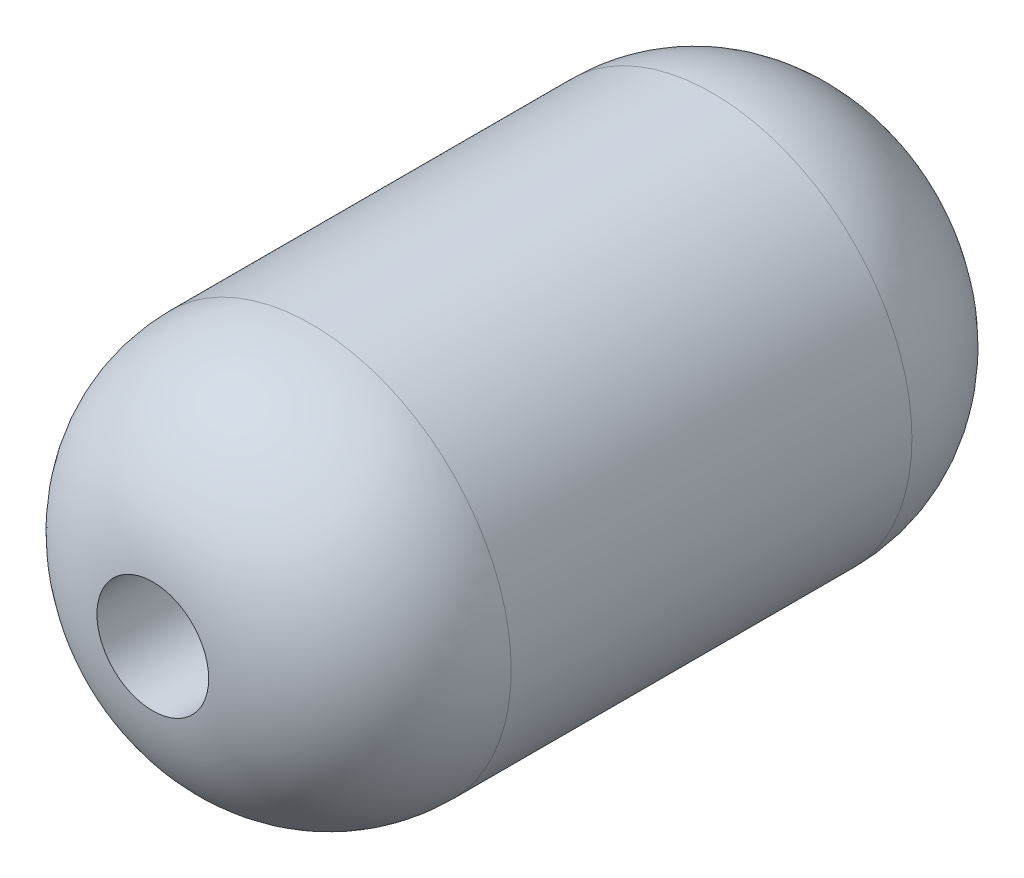
ISO-10303-21;
HEADER;
FILE_DESCRIPTION(('STEP AP214'),'2;1');
FILE_NAME('part.step','',(''),(''),'','','');
FILE_SCHEMA(('AUTOMOTIVE_DESIGN { 1 0 10303 214 1 1 1 1 }'));
ENDSEC;
DATA;
#1=APPLICATION_CONTEXT('core data for automotive mechanical design processes');
#2=APPLICATION_PROTOCOL_DEFINITION('international standard','automotive_design',2000,#1);
#3=PRODUCT_CONTEXT('',#1,'mechanical');
#4=PRODUCT('Part','Part','',(#3));
#5=PRODUCT_RELATED_PRODUCT_CATEGORY('part','',(#4));
#6=PRODUCT_DEFINITION_FORMATION('','',#4);
#7=PRODUCT_DEFINITION_CONTEXT('part definition',#1,'design');
#8=PRODUCT_DEFINITION('design','',#6,#7);
#9=PRODUCT_DEFINITION_SHAPE('','',#8);
#10=(LENGTH_UNIT() NAMED_UNIT(*) SI_UNIT(.MILLI.,.METRE.));
#11=(NAMED_UNIT(*) PLANE_ANGLE_UNIT() SI_UNIT($,.RADIAN.));
#12=(NAMED_UNIT(*) SI_UNIT($,.STERADIAN.) SOLID_ANGLE_UNIT());
#13=UNCERTAINTY_MEASURE_WITH_UNIT(LENGTH_MEASURE(1.E-05),#10,'distance_accuracy_value','');
#14=(GEOMETRIC_REPRESENTATION_CONTEXT(3) GLOBAL_UNCERTAINTY_ASSIGNED_CONTEXT((#13)) GLOBAL_UNIT_ASSIGNED_CONTEXT((#10,
#11,#12)) REPRESENTATION_CONTEXT('',''));
#15=CARTESIAN_POINT('',(0.,0.,0.));
#16=DIRECTION('',(0.,0.,1.));
#17=DIRECTION('',(1.,0.,0.));
#18=AXIS2_PLACEMENT_3D('',#15,#16,#17);
#19=CARTESIAN_POINT('',(-4.40280949364555,1.43632637579584,9.));
#20=DIRECTION('',(0.,0.,-1.));
#21=DIRECTION('',(-1.,0.,0.));
#22=AXIS2_PLACEMENT_3D('',#19,#20,#21);
#23=CYLINDRICAL_SURFACE('',#22,2.5);
#24=CARTESIAN_POINT('',(-4.40280949364555,1.43632637579584,1.98997487421324));
#25=DIRECTION('',(0.,0.,-1.));
#26=DIRECTION('',(-1.,0.,0.));
#27=AXIS2_PLACEMENT_3D('',#24,#25,#26);
#28=CIRCLE('',#27,2.5);
#29=CARTESIAN_POINT('',(-6.90280949364555,1.43632637579584,1.98997487421324));
#30=VERTEX_POINT('',#29);
#31=EDGE_CURVE('E10',#30,#30,#28,.F.);
#32=ORIENTED_EDGE('',*,*,#31,.T.);
#33=EDGE_LOOP('',(#32));
#34=FACE_BOUND('',#33,.T.);
#35=CARTESIAN_POINT('',(-4.40280949364555,1.43632637579584,7.01002512578676));
#36=DIRECTION('',(0.,0.,1.));
#37=DIRECTION('',(1.,0.,0.));
#38=AXIS2_PLACEMENT_3D('',#35,#36,#37);
#39=CIRCLE('',#38,2.5);
#40=CARTESIAN_POINT('',(-1.90280949364555,1.43632637579584,7.01002512578676));
#41=VERTEX_POINT('',#40);
#42=EDGE_CURVE('E42',#41,#41,#39,.F.);
#43=ORIENTED_EDGE('',*,*,#42,.T.);
#44=EDGE_LOOP('',(#43));
#45=FACE_BOUND('',#44,.T.);
#46=ADVANCED_FACE('F35',(#34,#45),#23,.T.);
#47=CARTESIAN_POINT('',(-4.40280949364555,1.43632637579584,9.));
#48=DIRECTION('',(0.,0.,-1.));
#49=DIRECTION('',(-1.,0.,0.));
#50=AXIS2_PLACEMENT_3D('',#47,#48,#49);
#51=CYLINDRICAL_SURFACE('',#50,0.7);
#52=CARTESIAN_POINT('',(-4.40280949364555,1.43632637579584,9.));
#53=DIRECTION('',(0.,0.,1.));
#54=DIRECTION('',(1.,0.,0.));
#55=AXIS2_PLACEMENT_3D('',#52,#53,#54);
#56=CIRCLE('',#55,0.7);
#57=CARTESIAN_POINT('',(-3.70280949364555,1.43632637579584,9.));
#58=VERTEX_POINT('',#57);
#59=EDGE_CURVE('E46',#58,#58,#56,.T.);
#60=ORIENTED_EDGE('',*,*,#59,.T.);
#61=EDGE_LOOP('',(#60));
#62=FACE_BOUND('',#61,.T.);
#63=CARTESIAN_POINT('',(-4.40280949364555,1.43632637579584,0.));
#64=DIRECTION('',(0.,0.,1.));
#65=DIRECTION('',(1.,0.,0.));
#66=AXIS2_PLACEMENT_3D('',#63,#64,#65);
#67=CIRCLE('',#66,0.7);
#68=CARTESIAN_POINT('',(-3.70280949364555,1.43632637579584,0.));
#69=VERTEX_POINT('',#68);
#70=EDGE_CURVE('E50',#69,#69,#67,.T.);
#71=ORIENTED_EDGE('',*,*,#70,.F.);
#72=EDGE_LOOP('',(#71));
#73=FACE_BOUND('',#72,.T.);
#74=ADVANCED_FACE('F59',(#62,#73),#51,.F.);
#75=CARTESIAN_POINT('',(-4.40280949364555,1.43632637579584,1.98997487421324));
#76=DIRECTION('',(0.,0.,-1.));
#77=DIRECTION('',(-1.,0.,0.));
#78=AXIS2_PLACEMENT_3D('',#75,#76,#77);
#79=DEGENERATE_TOROIDAL_SURFACE('',#78,0.5,2.,.T.);
#80=ORIENTED_EDGE('',*,*,#70,.T.);
#81=EDGE_LOOP('',(#80));
#82=FACE_BOUND('',#81,.T.);
#83=ORIENTED_EDGE('',*,*,#31,.F.);
#84=EDGE_LOOP('',(#83));
#85=FACE_BOUND('',#84,.T.);
#86=ADVANCED_FACE('F56',(#82,#85),#79,.T.);
#87=CARTESIAN_POINT('',(-4.40280949364555,1.43632637579584,7.01002512578676));
#88=DIRECTION('',(0.,0.,1.));
#89=DIRECTION('',(1.,0.,0.));
#90=AXIS2_PLACEMENT_3D('',#87,#88,#89);
#91=DEGENERATE_TOROIDAL_SURFACE('',#90,0.5,2.,.T.);
#92=ORIENTED_EDGE('',*,*,#42,.F.);
#93=EDGE_LOOP('',(#92));
#94=FACE_BOUND('',#93,.T.);
#95=ORIENTED_EDGE('',*,*,#59,.F.);
#96=EDGE_LOOP('',(#95));
#97=FACE_BOUND('',#96,.T.);
#98=ADVANCED_FACE('F37',(#94,#97),#91,.T.);
#99=CLOSED_SHELL('',(#46,#74,#86,#98));
#100=MANIFOLD_SOLID_BREP('B2',#99);
#101=ADVANCED_BREP_SHAPE_REPRESENTATION('',(#18,#100),#14);
#102=SHAPE_DEFINITION_REPRESENTATION(#9,#101);
ENDSEC;
END-ISO-10303-21;
